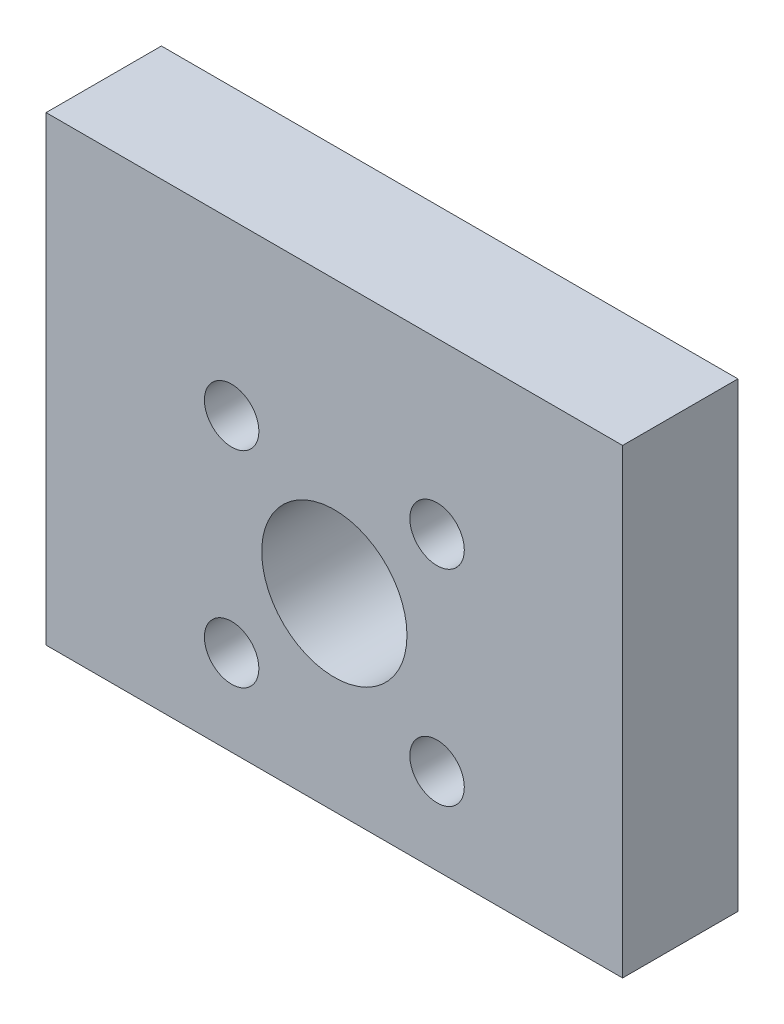
ISO-10303-21;
HEADER;
FILE_DESCRIPTION(('STEP AP214'),'2;1');
FILE_NAME('part.step','',(''),(''),'','','');
FILE_SCHEMA(('AUTOMOTIVE_DESIGN { 1 0 10303 214 1 1 1 1 }'));
ENDSEC;
DATA;
#1=APPLICATION_CONTEXT('core data for automotive mechanical design processes');
#2=APPLICATION_PROTOCOL_DEFINITION('international standard','automotive_design',2000,#1);
#3=PRODUCT_CONTEXT('',#1,'mechanical');
#4=PRODUCT('Part','Part','',(#3));
#5=PRODUCT_RELATED_PRODUCT_CATEGORY('part','',(#4));
#6=PRODUCT_DEFINITION_FORMATION('','',#4);
#7=PRODUCT_DEFINITION_CONTEXT('part definition',#1,'design');
#8=PRODUCT_DEFINITION('design','',#6,#7);
#9=PRODUCT_DEFINITION_SHAPE('','',#8);
#10=(LENGTH_UNIT() NAMED_UNIT(*) SI_UNIT(.MILLI.,.METRE.));
#11=(NAMED_UNIT(*) PLANE_ANGLE_UNIT() SI_UNIT($,.RADIAN.));
#12=(NAMED_UNIT(*) SI_UNIT($,.STERADIAN.) SOLID_ANGLE_UNIT());
#13=UNCERTAINTY_MEASURE_WITH_UNIT(LENGTH_MEASURE(1.E-05),#10,'distance_accuracy_value','');
#14=(GEOMETRIC_REPRESENTATION_CONTEXT(3) GLOBAL_UNCERTAINTY_ASSIGNED_CONTEXT((#13)) GLOBAL_UNIT_ASSIGNED_CONTEXT((#10,
#11,#12)) REPRESENTATION_CONTEXT('',''));
#15=CARTESIAN_POINT('',(0.,0.,0.));
#16=DIRECTION('',(0.,0.,1.));
#17=DIRECTION('',(1.,0.,0.));
#18=AXIS2_PLACEMENT_3D('',#15,#16,#17);
#19=CARTESIAN_POINT('',(-31.75,0.,6.35));
#20=DIRECTION('',(-1.,0.,0.));
#21=DIRECTION('',(0.,0.,1.));
#22=AXIS2_PLACEMENT_3D('',#19,#20,#21);
#23=PLANE('',#22);
#24=DIRECTION('',(0.,1.,0.));
#25=VECTOR('',#24,1.);
#26=CARTESIAN_POINT('',(-31.75,0.,0.));
#27=LINE('',#26,#25);
#28=CARTESIAN_POINT('',(-31.75,0.,0.));
#29=VERTEX_POINT('',#28);
#30=CARTESIAN_POINT('',(-31.75,25.4,0.));
#31=VERTEX_POINT('',#30);
#32=EDGE_CURVE('E150',#29,#31,#27,.T.);
#33=ORIENTED_EDGE('',*,*,#32,.F.);
#34=DIRECTION('',(0.,0.,-1.));
#35=VECTOR('',#34,1.);
#36=CARTESIAN_POINT('',(-31.75,0.,6.35));
#37=LINE('',#36,#35);
#38=CARTESIAN_POINT('',(-31.75,0.,6.35));
#39=VERTEX_POINT('',#38);
#40=EDGE_CURVE('E11',#39,#29,#37,.T.);
#41=ORIENTED_EDGE('',*,*,#40,.F.);
#42=DIRECTION('',(0.,1.,0.));
#43=VECTOR('',#42,1.);
#44=CARTESIAN_POINT('',(-31.75,0.,6.35));
#45=LINE('',#44,#43);
#46=CARTESIAN_POINT('',(-31.75,25.4,6.35));
#47=VERTEX_POINT('',#46);
#48=EDGE_CURVE('E140',#39,#47,#45,.T.);
#49=ORIENTED_EDGE('',*,*,#48,.T.);
#50=DIRECTION('',(0.,0.,-1.));
#51=VECTOR('',#50,1.);
#52=CARTESIAN_POINT('',(-31.75,25.4,6.35));
#53=LINE('',#52,#51);
#54=EDGE_CURVE('E81',#47,#31,#53,.T.);
#55=ORIENTED_EDGE('',*,*,#54,.T.);
#56=EDGE_LOOP('',(#33,#41,#49,#55));
#57=FACE_BOUND('',#56,.T.);
#58=ADVANCED_FACE('F40',(#57),#23,.T.);
#59=CARTESIAN_POINT('',(0.,0.,6.35));
#60=DIRECTION('',(0.,-1.,0.));
#61=DIRECTION('',(0.,0.,-1.));
#62=AXIS2_PLACEMENT_3D('',#59,#60,#61);
#63=PLANE('',#62);
#64=CARTESIAN_POINT('',(-6.35,0.,3.175));
#65=DIRECTION('',(0.,-1.,0.));
#66=DIRECTION('',(0.,0.,-1.));
#67=AXIS2_PLACEMENT_3D('',#64,#65,#66);
#68=CIRCLE('',#67,1.5);
#69=CARTESIAN_POINT('',(-6.35,0.,1.675));
#70=VERTEX_POINT('',#69);
#71=EDGE_CURVE('E102',#70,#70,#68,.T.);
#72=ORIENTED_EDGE('',*,*,#71,.F.);
#73=EDGE_LOOP('',(#72));
#74=FACE_BOUND('',#73,.T.);
#75=CARTESIAN_POINT('',(-25.4,0.,3.175));
#76=DIRECTION('',(0.,-1.,0.));
#77=DIRECTION('',(0.,0.,-1.));
#78=AXIS2_PLACEMENT_3D('',#75,#76,#77);
#79=CIRCLE('',#78,1.5);
#80=CARTESIAN_POINT('',(-25.4,0.,1.675));
#81=VERTEX_POINT('',#80);
#82=EDGE_CURVE('E101',#81,#81,#79,.T.);
#83=ORIENTED_EDGE('',*,*,#82,.F.);
#84=EDGE_LOOP('',(#83));
#85=FACE_BOUND('',#84,.T.);
#86=DIRECTION('',(-1.,0.,0.));
#87=VECTOR('',#86,1.);
#88=CARTESIAN_POINT('',(0.,0.,0.));
#89=LINE('',#88,#87);
#90=CARTESIAN_POINT('',(0.,0.,0.));
#91=VERTEX_POINT('',#90);
#92=EDGE_CURVE('E152',#91,#29,#89,.T.);
#93=ORIENTED_EDGE('',*,*,#92,.F.);
#94=DIRECTION('',(0.,0.,-1.));
#95=VECTOR('',#94,1.);
#96=CARTESIAN_POINT('',(0.,0.,6.35));
#97=LINE('',#96,#95);
#98=CARTESIAN_POINT('',(0.,0.,6.35));
#99=VERTEX_POINT('',#98);
#100=EDGE_CURVE('E49',#99,#91,#97,.T.);
#101=ORIENTED_EDGE('',*,*,#100,.F.);
#102=DIRECTION('',(-1.,0.,0.));
#103=VECTOR('',#102,1.);
#104=CARTESIAN_POINT('',(0.,0.,6.35));
#105=LINE('',#104,#103);
#106=EDGE_CURVE('E142',#99,#39,#105,.T.);
#107=ORIENTED_EDGE('',*,*,#106,.T.);
#108=ORIENTED_EDGE('',*,*,#40,.T.);
#109=EDGE_LOOP('',(#93,#101,#107,#108));
#110=FACE_BOUND('',#109,.T.);
#111=ADVANCED_FACE('F169',(#74,#85,#110),#63,.T.);
#112=CARTESIAN_POINT('',(0.,0.,6.35));
#113=DIRECTION('',(-1.,0.,0.));
#114=DIRECTION('',(0.,0.,1.));
#115=AXIS2_PLACEMENT_3D('',#112,#113,#114);
#116=PLANE('',#115);
#117=DIRECTION('',(0.,1.,0.));
#118=VECTOR('',#117,1.);
#119=CARTESIAN_POINT('',(0.,0.,0.));
#120=LINE('',#119,#118);
#121=CARTESIAN_POINT('',(0.,25.4,0.));
#122=VERTEX_POINT('',#121);
#123=EDGE_CURVE('E155',#91,#122,#120,.T.);
#124=ORIENTED_EDGE('',*,*,#123,.T.);
#125=DIRECTION('',(0.,0.,-1.));
#126=VECTOR('',#125,1.);
#127=CARTESIAN_POINT('',(0.,25.4,6.35));
#128=LINE('',#127,#126);
#129=CARTESIAN_POINT('',(0.,25.4,6.35));
#130=VERTEX_POINT('',#129);
#131=EDGE_CURVE('E160',#130,#122,#128,.T.);
#132=ORIENTED_EDGE('',*,*,#131,.F.);
#133=DIRECTION('',(0.,1.,0.));
#134=VECTOR('',#133,1.);
#135=CARTESIAN_POINT('',(0.,0.,6.35));
#136=LINE('',#135,#134);
#137=EDGE_CURVE('E145',#99,#130,#136,.T.);
#138=ORIENTED_EDGE('',*,*,#137,.F.);
#139=ORIENTED_EDGE('',*,*,#100,.T.);
#140=EDGE_LOOP('',(#124,#132,#138,#139));
#141=FACE_BOUND('',#140,.T.);
#142=ADVANCED_FACE('F163',(#141),#116,.F.);
#143=CARTESIAN_POINT('',(-15.875,10.4,6.35));
#144=DIRECTION('',(0.,0.,-1.));
#145=DIRECTION('',(-1.,0.,0.));
#146=AXIS2_PLACEMENT_3D('',#143,#144,#145);
#147=CYLINDRICAL_SURFACE('',#146,4.);
#148=CARTESIAN_POINT('',(-15.875,10.4,6.35));
#149=DIRECTION('',(0.,0.,1.));
#150=DIRECTION('',(1.,0.,0.));
#151=AXIS2_PLACEMENT_3D('',#148,#149,#150);
#152=CIRCLE('',#151,4.);
#153=CARTESIAN_POINT('',(-11.875,10.4,6.35));
#154=VERTEX_POINT('',#153);
#155=EDGE_CURVE('E137',#154,#154,#152,.T.);
#156=ORIENTED_EDGE('',*,*,#155,.T.);
#157=EDGE_LOOP('',(#156));
#158=FACE_BOUND('',#157,.T.);
#159=CARTESIAN_POINT('',(-15.875,10.4,0.));
#160=DIRECTION('',(0.,0.,1.));
#161=DIRECTION('',(1.,0.,0.));
#162=AXIS2_PLACEMENT_3D('',#159,#160,#161);
#163=CIRCLE('',#162,4.);
#164=CARTESIAN_POINT('',(-11.875,10.4,0.));
#165=VERTEX_POINT('',#164);
#166=EDGE_CURVE('E136',#165,#165,#163,.T.);
#167=ORIENTED_EDGE('',*,*,#166,.F.);
#168=EDGE_LOOP('',(#167));
#169=FACE_BOUND('',#168,.T.);
#170=ADVANCED_FACE('F42',(#158,#169),#147,.F.);
#171=CARTESIAN_POINT('',(0.,25.4,6.35));
#172=DIRECTION('',(0.,-1.,0.));
#173=DIRECTION('',(1.,0.,0.));
#174=AXIS2_PLACEMENT_3D('',#171,#172,#173);
#175=PLANE('',#174);
#176=DIRECTION('',(-1.,0.,0.));
#177=VECTOR('',#176,1.);
#178=CARTESIAN_POINT('',(0.,25.4,0.));
#179=LINE('',#178,#177);
#180=EDGE_CURVE('E74',#122,#31,#179,.T.);
#181=ORIENTED_EDGE('',*,*,#180,.T.);
#182=ORIENTED_EDGE('',*,*,#54,.F.);
#183=DIRECTION('',(-1.,0.,0.));
#184=VECTOR('',#183,1.);
#185=CARTESIAN_POINT('',(0.,25.4,6.35));
#186=LINE('',#185,#184);
#187=EDGE_CURVE('E57',#130,#47,#186,.T.);
#188=ORIENTED_EDGE('',*,*,#187,.F.);
#189=ORIENTED_EDGE('',*,*,#131,.T.);
#190=EDGE_LOOP('',(#181,#182,#188,#189));
#191=FACE_BOUND('',#190,.T.);
#192=ADVANCED_FACE('F179',(#191),#175,.F.);
#193=CARTESIAN_POINT('',(0.,0.,6.35));
#194=DIRECTION('',(0.,0.,1.));
#195=DIRECTION('',(1.,0.,0.));
#196=AXIS2_PLACEMENT_3D('',#193,#194,#195);
#197=PLANE('',#196);
#198=CARTESIAN_POINT('',(-10.2181457505077,16.0568542494924,6.35));
#199=DIRECTION('',(0.,0.,1.));
#200=DIRECTION('',(1.,0.,0.));
#201=AXIS2_PLACEMENT_3D('',#198,#199,#200);
#202=CIRCLE('',#201,1.5);
#203=CARTESIAN_POINT('',(-8.71814575050766,16.0568542494924,6.35));
#204=VERTEX_POINT('',#203);
#205=EDGE_CURVE('E112',#204,#204,#202,.T.);
#206=ORIENTED_EDGE('',*,*,#205,.F.);
#207=EDGE_LOOP('',(#206));
#208=FACE_BOUND('',#207,.T.);
#209=CARTESIAN_POINT('',(-10.2181457505076,4.74314575050761,6.35));
#210=DIRECTION('',(0.,0.,1.));
#211=DIRECTION('',(1.,0.,0.));
#212=AXIS2_PLACEMENT_3D('',#209,#210,#211);
#213=CIRCLE('',#212,1.5);
#214=CARTESIAN_POINT('',(-8.71814575050763,4.74314575050761,6.35));
#215=VERTEX_POINT('',#214);
#216=EDGE_CURVE('E118',#215,#215,#213,.T.);
#217=ORIENTED_EDGE('',*,*,#216,.F.);
#218=EDGE_LOOP('',(#217));
#219=FACE_BOUND('',#218,.T.);
#220=CARTESIAN_POINT('',(-21.5318542494924,4.74314575050761,6.35));
#221=DIRECTION('',(0.,0.,1.));
#222=DIRECTION('',(1.,0.,0.));
#223=AXIS2_PLACEMENT_3D('',#220,#221,#222);
#224=CIRCLE('',#223,1.5);
#225=CARTESIAN_POINT('',(-20.0318542494924,4.74314575050761,6.35));
#226=VERTEX_POINT('',#225);
#227=EDGE_CURVE('E124',#226,#226,#224,.T.);
#228=ORIENTED_EDGE('',*,*,#227,.F.);
#229=EDGE_LOOP('',(#228));
#230=FACE_BOUND('',#229,.T.);
#231=CARTESIAN_POINT('',(-21.5318542494924,16.0568542494924,6.35));
#232=DIRECTION('',(0.,0.,1.));
#233=DIRECTION('',(1.,0.,0.));
#234=AXIS2_PLACEMENT_3D('',#231,#232,#233);
#235=CIRCLE('',#234,1.5);
#236=CARTESIAN_POINT('',(-20.0318542494924,16.0568542494924,6.35));
#237=VERTEX_POINT('',#236);
#238=EDGE_CURVE('E130',#237,#237,#235,.T.);
#239=ORIENTED_EDGE('',*,*,#238,.F.);
#240=EDGE_LOOP('',(#239));
#241=FACE_BOUND('',#240,.T.);
#242=ORIENTED_EDGE('',*,*,#155,.F.);
#243=EDGE_LOOP('',(#242));
#244=FACE_BOUND('',#243,.T.);
#245=ORIENTED_EDGE('',*,*,#48,.F.);
#246=ORIENTED_EDGE('',*,*,#106,.F.);
#247=ORIENTED_EDGE('',*,*,#137,.T.);
#248=ORIENTED_EDGE('',*,*,#187,.T.);
#249=EDGE_LOOP('',(#245,#246,#247,#248));
#250=FACE_BOUND('',#249,.T.);
#251=ADVANCED_FACE('F182',(#208,#219,#230,#241,#244,#250),#197,.T.);
#252=CARTESIAN_POINT('',(0.,0.,0.));
#253=DIRECTION('',(0.,0.,1.));
#254=DIRECTION('',(1.,0.,0.));
#255=AXIS2_PLACEMENT_3D('',#252,#253,#254);
#256=PLANE('',#255);
#257=CARTESIAN_POINT('',(-10.2181457505077,16.0568542494924,0.));
#258=DIRECTION('',(0.,0.,1.));
#259=DIRECTION('',(1.,0.,0.));
#260=AXIS2_PLACEMENT_3D('',#257,#258,#259);
#261=CIRCLE('',#260,1.5);
#262=CARTESIAN_POINT('',(-8.71814575050767,16.0568542494924,0.));
#263=VERTEX_POINT('',#262);
#264=EDGE_CURVE('E115',#263,#263,#261,.T.);
#265=ORIENTED_EDGE('',*,*,#264,.T.);
#266=EDGE_LOOP('',(#265));
#267=FACE_BOUND('',#266,.T.);
#268=CARTESIAN_POINT('',(-10.2181457505076,4.74314575050761,0.));
#269=DIRECTION('',(0.,0.,1.));
#270=DIRECTION('',(1.,0.,0.));
#271=AXIS2_PLACEMENT_3D('',#268,#269,#270);
#272=CIRCLE('',#271,1.5);
#273=CARTESIAN_POINT('',(-8.71814575050763,4.74314575050761,0.));
#274=VERTEX_POINT('',#273);
#275=EDGE_CURVE('E121',#274,#274,#272,.T.);
#276=ORIENTED_EDGE('',*,*,#275,.T.);
#277=EDGE_LOOP('',(#276));
#278=FACE_BOUND('',#277,.T.);
#279=CARTESIAN_POINT('',(-21.5318542494924,4.74314575050761,0.));
#280=DIRECTION('',(0.,0.,1.));
#281=DIRECTION('',(1.,0.,0.));
#282=AXIS2_PLACEMENT_3D('',#279,#280,#281);
#283=CIRCLE('',#282,1.5);
#284=CARTESIAN_POINT('',(-20.0318542494924,4.74314575050761,0.));
#285=VERTEX_POINT('',#284);
#286=EDGE_CURVE('E127',#285,#285,#283,.T.);
#287=ORIENTED_EDGE('',*,*,#286,.T.);
#288=EDGE_LOOP('',(#287));
#289=FACE_BOUND('',#288,.T.);
#290=CARTESIAN_POINT('',(-21.5318542494924,16.0568542494924,0.));
#291=DIRECTION('',(0.,0.,1.));
#292=DIRECTION('',(1.,0.,0.));
#293=AXIS2_PLACEMENT_3D('',#290,#291,#292);
#294=CIRCLE('',#293,1.5);
#295=CARTESIAN_POINT('',(-20.0318542494924,16.0568542494924,0.));
#296=VERTEX_POINT('',#295);
#297=EDGE_CURVE('E133',#296,#296,#294,.T.);
#298=ORIENTED_EDGE('',*,*,#297,.T.);
#299=EDGE_LOOP('',(#298));
#300=FACE_BOUND('',#299,.T.);
#301=ORIENTED_EDGE('',*,*,#166,.T.);
#302=EDGE_LOOP('',(#301));
#303=FACE_BOUND('',#302,.T.);
#304=ORIENTED_EDGE('',*,*,#32,.T.);
#305=ORIENTED_EDGE('',*,*,#180,.F.);
#306=ORIENTED_EDGE('',*,*,#123,.F.);
#307=ORIENTED_EDGE('',*,*,#92,.T.);
#308=EDGE_LOOP('',(#304,#305,#306,#307));
#309=FACE_BOUND('',#308,.T.);
#310=ADVANCED_FACE('F168',(#267,#278,#289,#300,#303,#309),#256,.F.);
#311=CARTESIAN_POINT('',(-21.5318542494924,16.0568542494924,6.35));
#312=DIRECTION('',(0.,0.,1.));
#313=DIRECTION('',(1.,0.,0.));
#314=AXIS2_PLACEMENT_3D('',#311,#312,#313);
#315=CYLINDRICAL_SURFACE('',#314,1.5);
#316=ORIENTED_EDGE('',*,*,#297,.F.);
#317=EDGE_LOOP('',(#316));
#318=FACE_BOUND('',#317,.T.);
#319=ORIENTED_EDGE('',*,*,#238,.T.);
#320=EDGE_LOOP('',(#319));
#321=FACE_BOUND('',#320,.T.);
#322=ADVANCED_FACE('F186',(#318,#321),#315,.F.);
#323=CARTESIAN_POINT('',(-21.5318542494924,4.74314575050761,6.35));
#324=DIRECTION('',(0.,0.,1.));
#325=DIRECTION('',(1.,0.,0.));
#326=AXIS2_PLACEMENT_3D('',#323,#324,#325);
#327=CYLINDRICAL_SURFACE('',#326,1.5);
#328=ORIENTED_EDGE('',*,*,#286,.F.);
#329=EDGE_LOOP('',(#328));
#330=FACE_BOUND('',#329,.T.);
#331=ORIENTED_EDGE('',*,*,#227,.T.);
#332=EDGE_LOOP('',(#331));
#333=FACE_BOUND('',#332,.T.);
#334=ADVANCED_FACE('F193',(#330,#333),#327,.F.);
#335=CARTESIAN_POINT('',(-10.2181457505076,4.74314575050761,6.35));
#336=DIRECTION('',(0.,0.,1.));
#337=DIRECTION('',(1.,0.,0.));
#338=AXIS2_PLACEMENT_3D('',#335,#336,#337);
#339=CYLINDRICAL_SURFACE('',#338,1.5);
#340=ORIENTED_EDGE('',*,*,#275,.F.);
#341=EDGE_LOOP('',(#340));
#342=FACE_BOUND('',#341,.T.);
#343=ORIENTED_EDGE('',*,*,#216,.T.);
#344=EDGE_LOOP('',(#343));
#345=FACE_BOUND('',#344,.T.);
#346=ADVANCED_FACE('F197',(#342,#345),#339,.F.);
#347=CARTESIAN_POINT('',(-10.2181457505077,16.0568542494924,6.35));
#348=DIRECTION('',(0.,0.,1.));
#349=DIRECTION('',(1.,0.,0.));
#350=AXIS2_PLACEMENT_3D('',#347,#348,#349);
#351=CYLINDRICAL_SURFACE('',#350,1.5);
#352=ORIENTED_EDGE('',*,*,#264,.F.);
#353=EDGE_LOOP('',(#352));
#354=FACE_BOUND('',#353,.T.);
#355=ORIENTED_EDGE('',*,*,#205,.T.);
#356=EDGE_LOOP('',(#355));
#357=FACE_BOUND('',#356,.T.);
#358=ADVANCED_FACE('F201',(#354,#357),#351,.F.);
#359=CARTESIAN_POINT('',(-25.4,4.99999999999991,3.175));
#360=DIRECTION('',(0.,-1.,0.));
#361=DIRECTION('',(0.,0.,-1.));
#362=AXIS2_PLACEMENT_3D('',#359,#360,#361);
#363=CONICAL_SURFACE('',#362,1.5,1.02974425867665);
#364=CARTESIAN_POINT('',(-25.4,5.90129092854126,3.175));
#365=VERTEX_POINT('',#364);
#366=VERTEX_LOOP('',#365);
#367=FACE_BOUND('',#366,.T.);
#368=CARTESIAN_POINT('',(-25.4,4.99999999999991,3.175));
#369=DIRECTION('',(0.,-1.,0.));
#370=DIRECTION('',(0.,0.,-1.));
#371=AXIS2_PLACEMENT_3D('',#368,#369,#370);
#372=CIRCLE('',#371,1.5);
#373=CARTESIAN_POINT('',(-25.4,4.99999999999991,1.675));
#374=VERTEX_POINT('',#373);
#375=EDGE_CURVE('E105',#374,#374,#372,.T.);
#376=ORIENTED_EDGE('',*,*,#375,.T.);
#377=EDGE_LOOP('',(#376));
#378=FACE_BOUND('',#377,.T.);
#379=ADVANCED_FACE('F205',(#367,#378),#363,.F.);
#380=CARTESIAN_POINT('',(-25.4,0.,3.175));
#381=DIRECTION('',(0.,-1.,0.));
#382=DIRECTION('',(0.,0.,-1.));
#383=AXIS2_PLACEMENT_3D('',#380,#381,#382);
#384=CYLINDRICAL_SURFACE('',#383,1.5);
#385=ORIENTED_EDGE('',*,*,#375,.F.);
#386=EDGE_LOOP('',(#385));
#387=FACE_BOUND('',#386,.T.);
#388=ORIENTED_EDGE('',*,*,#82,.T.);
#389=EDGE_LOOP('',(#388));
#390=FACE_BOUND('',#389,.T.);
#391=ADVANCED_FACE('F95',(#387,#390),#384,.F.);
#392=CARTESIAN_POINT('',(-6.35,4.99999999999998,3.175));
#393=DIRECTION('',(0.,-1.,0.));
#394=DIRECTION('',(0.,0.,-1.));
#395=AXIS2_PLACEMENT_3D('',#392,#393,#394);
#396=CONICAL_SURFACE('',#395,1.5,1.02974425867665);
#397=CARTESIAN_POINT('',(-6.35,5.90129092854132,3.175));
#398=VERTEX_POINT('',#397);
#399=VERTEX_LOOP('',#398);
#400=FACE_BOUND('',#399,.T.);
#401=CARTESIAN_POINT('',(-6.35,4.99999999999998,3.175));
#402=DIRECTION('',(0.,-1.,0.));
#403=DIRECTION('',(0.,0.,-1.));
#404=AXIS2_PLACEMENT_3D('',#401,#402,#403);
#405=CIRCLE('',#404,1.5);
#406=CARTESIAN_POINT('',(-6.35,4.99999999999998,1.675));
#407=VERTEX_POINT('',#406);
#408=EDGE_CURVE('E99',#407,#407,#405,.T.);
#409=ORIENTED_EDGE('',*,*,#408,.T.);
#410=EDGE_LOOP('',(#409));
#411=FACE_BOUND('',#410,.T.);
#412=ADVANCED_FACE('F91',(#400,#411),#396,.F.);
#413=CARTESIAN_POINT('',(-6.35,0.,3.175));
#414=DIRECTION('',(0.,-1.,0.));
#415=DIRECTION('',(0.,0.,-1.));
#416=AXIS2_PLACEMENT_3D('',#413,#414,#415);
#417=CYLINDRICAL_SURFACE('',#416,1.5);
#418=ORIENTED_EDGE('',*,*,#408,.F.);
#419=EDGE_LOOP('',(#418));
#420=FACE_BOUND('',#419,.T.);
#421=ORIENTED_EDGE('',*,*,#71,.T.);
#422=EDGE_LOOP('',(#421));
#423=FACE_BOUND('',#422,.T.);
#424=ADVANCED_FACE('F94',(#420,#423),#417,.F.);
#425=CLOSED_SHELL('',(#58,#111,#142,#170,#192,#251,#310,#322,#334,#346,#358,#379,#391,#412,#424));
#426=MANIFOLD_SOLID_BREP('B2',#425);
#427=ADVANCED_BREP_SHAPE_REPRESENTATION('',(#18,#426),#14);
#428=SHAPE_DEFINITION_REPRESENTATION(#9,#427);
ENDSEC;
END-ISO-10303-21;
